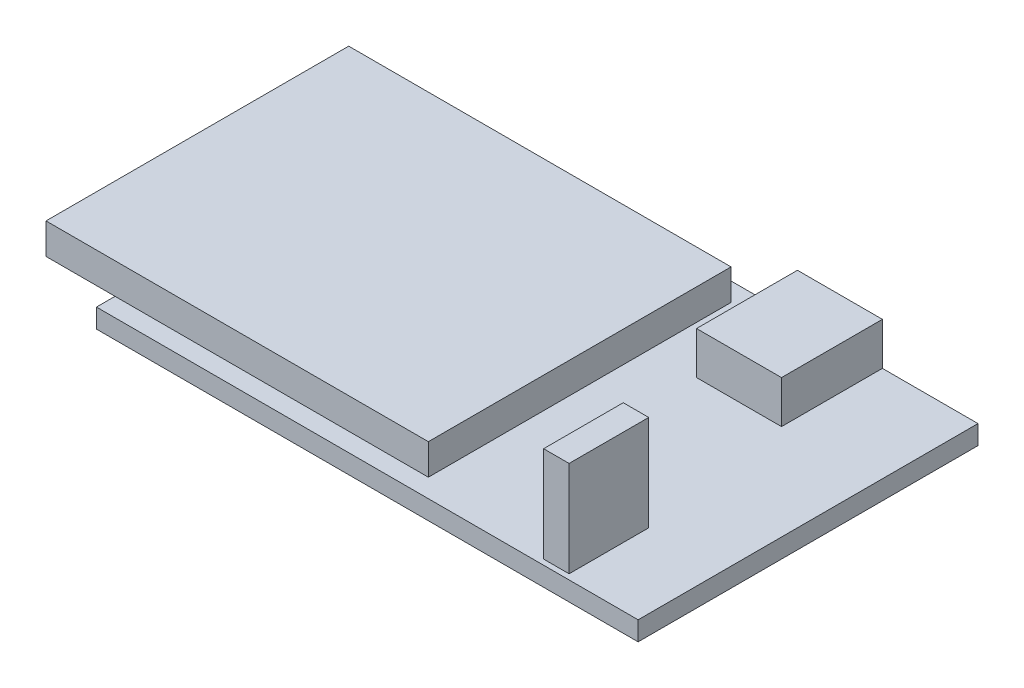
ISO-10303-21;
HEADER;
FILE_DESCRIPTION(('STEP AP214'),'2;1');
FILE_NAME('part.step','',(''),(''),'','','');
FILE_SCHEMA(('AUTOMOTIVE_DESIGN { 1 0 10303 214 1 1 1 1 }'));
ENDSEC;
DATA;
#1=APPLICATION_CONTEXT('core data for automotive mechanical design processes');
#2=APPLICATION_PROTOCOL_DEFINITION('international standard','automotive_design',2000,#1);
#3=PRODUCT_CONTEXT('',#1,'mechanical');
#4=PRODUCT('Part','Part','',(#3));
#5=PRODUCT_RELATED_PRODUCT_CATEGORY('part','',(#4));
#6=PRODUCT_DEFINITION_FORMATION('','',#4);
#7=PRODUCT_DEFINITION_CONTEXT('part definition',#1,'design');
#8=PRODUCT_DEFINITION('design','',#6,#7);
#9=PRODUCT_DEFINITION_SHAPE('','',#8);
#10=(LENGTH_UNIT() NAMED_UNIT(*) SI_UNIT(.MILLI.,.METRE.));
#11=(NAMED_UNIT(*) PLANE_ANGLE_UNIT() SI_UNIT($,.RADIAN.));
#12=(NAMED_UNIT(*) SI_UNIT($,.STERADIAN.) SOLID_ANGLE_UNIT());
#13=UNCERTAINTY_MEASURE_WITH_UNIT(LENGTH_MEASURE(1.E-05),#10,'distance_accuracy_value','');
#14=(GEOMETRIC_REPRESENTATION_CONTEXT(3) GLOBAL_UNCERTAINTY_ASSIGNED_CONTEXT((#13)) GLOBAL_UNIT_ASSIGNED_CONTEXT((#10,
#11,#12)) REPRESENTATION_CONTEXT('',''));
#15=CARTESIAN_POINT('',(0.,0.,0.));
#16=DIRECTION('',(0.,0.,1.));
#17=DIRECTION('',(1.,0.,0.));
#18=AXIS2_PLACEMENT_3D('',#15,#16,#17);
#19=CARTESIAN_POINT('',(0.,1.8,-32.));
#20=DIRECTION('',(0.,-1.,0.));
#21=DIRECTION('',(0.,0.,-1.));
#22=AXIS2_PLACEMENT_3D('',#19,#20,#21);
#23=PLANE('',#22);
#24=DIRECTION('',(0.,0.,1.));
#25=VECTOR('',#24,1.);
#26=CARTESIAN_POINT('',(41.6,1.8,-8.));
#27=LINE('',#26,#25);
#28=CARTESIAN_POINT('',(41.6,1.8,-8.));
#29=VERTEX_POINT('',#28);
#30=CARTESIAN_POINT('',(41.6,1.8,-0.5));
#31=VERTEX_POINT('',#30);
#32=EDGE_CURVE('E172',#29,#31,#27,.T.);
#33=ORIENTED_EDGE('',*,*,#32,.F.);
#34=DIRECTION('',(-1.,0.,0.));
#35=VECTOR('',#34,1.);
#36=CARTESIAN_POINT('',(41.6,1.8,-8.));
#37=LINE('',#36,#35);
#38=CARTESIAN_POINT('',(44.,1.8,-8.));
#39=VERTEX_POINT('',#38);
#40=EDGE_CURVE('E185',#39,#29,#37,.T.);
#41=ORIENTED_EDGE('',*,*,#40,.F.);
#42=DIRECTION('',(0.,0.,-1.));
#43=VECTOR('',#42,1.);
#44=CARTESIAN_POINT('',(44.,1.8,-8.));
#45=LINE('',#44,#43);
#46=CARTESIAN_POINT('',(44.,1.8,-0.5));
#47=VERTEX_POINT('',#46);
#48=EDGE_CURVE('E194',#47,#39,#45,.T.);
#49=ORIENTED_EDGE('',*,*,#48,.F.);
#50=DIRECTION('',(1.,0.,0.));
#51=VECTOR('',#50,1.);
#52=CARTESIAN_POINT('',(41.6,1.8,-0.5));
#53=LINE('',#52,#51);
#54=EDGE_CURVE('E175',#31,#47,#53,.T.);
#55=ORIENTED_EDGE('',*,*,#54,.F.);
#56=EDGE_LOOP('',(#33,#41,#49,#55));
#57=FACE_BOUND('',#56,.T.);
#58=DIRECTION('',(0.,0.,1.));
#59=VECTOR('',#58,1.);
#60=CARTESIAN_POINT('',(34.,1.8,-32.));
#61=LINE('',#60,#59);
#62=CARTESIAN_POINT('',(34.,1.8,-32.));
#63=VERTEX_POINT('',#62);
#64=CARTESIAN_POINT('',(34.,1.8,-22.5));
#65=VERTEX_POINT('',#64);
#66=EDGE_CURVE('E171',#63,#65,#61,.T.);
#67=ORIENTED_EDGE('',*,*,#66,.F.);
#68=DIRECTION('',(-1.,0.,0.));
#69=VECTOR('',#68,1.);
#70=CARTESIAN_POINT('',(0.,1.8,-32.));
#71=LINE('',#70,#69);
#72=CARTESIAN_POINT('',(0.,1.8,-32.));
#73=VERTEX_POINT('',#72);
#74=EDGE_CURVE('E250',#63,#73,#71,.T.);
#75=ORIENTED_EDGE('',*,*,#74,.T.);
#76=DIRECTION('',(0.,0.,1.));
#77=VECTOR('',#76,1.);
#78=CARTESIAN_POINT('',(0.,1.8,0.));
#79=LINE('',#78,#77);
#80=CARTESIAN_POINT('',(0.,1.8,-30.25));
#81=VERTEX_POINT('',#80);
#82=EDGE_CURVE('E242',#73,#81,#79,.T.);
#83=ORIENTED_EDGE('',*,*,#82,.T.);
#84=DIRECTION('',(-1.,0.,0.));
#85=VECTOR('',#84,1.);
#86=CARTESIAN_POINT('',(29.5,1.8,-30.25));
#87=LINE('',#86,#85);
#88=CARTESIAN_POINT('',(29.5,1.8,-30.25));
#89=VERTEX_POINT('',#88);
#90=EDGE_CURVE('E224',#89,#81,#87,.T.);
#91=ORIENTED_EDGE('',*,*,#90,.F.);
#92=DIRECTION('',(0.,0.,-1.));
#93=VECTOR('',#92,1.);
#94=CARTESIAN_POINT('',(29.5,1.8,-30.25));
#95=LINE('',#94,#93);
#96=CARTESIAN_POINT('',(29.5,1.8,-1.75000000000001));
#97=VERTEX_POINT('',#96);
#98=EDGE_CURVE('E210',#97,#89,#95,.T.);
#99=ORIENTED_EDGE('',*,*,#98,.F.);
#100=DIRECTION('',(1.,0.,0.));
#101=VECTOR('',#100,1.);
#102=CARTESIAN_POINT('',(29.5,1.8,-1.75000000000001));
#103=LINE('',#102,#101);
#104=CARTESIAN_POINT('',(0.,1.8,-1.75));
#105=VERTEX_POINT('',#104);
#106=EDGE_CURVE('E11',#105,#97,#103,.T.);
#107=ORIENTED_EDGE('',*,*,#106,.F.);
#108=CARTESIAN_POINT('',(0.,1.8,0.));
#109=VERTEX_POINT('',#108);
#110=EDGE_CURVE('E246',#105,#109,#79,.T.);
#111=ORIENTED_EDGE('',*,*,#110,.T.);
#112=DIRECTION('',(1.,0.,0.));
#113=VECTOR('',#112,1.);
#114=CARTESIAN_POINT('',(0.,1.8,0.));
#115=LINE('',#114,#113);
#116=CARTESIAN_POINT('',(51.,1.8,0.));
#117=VERTEX_POINT('',#116);
#118=EDGE_CURVE('E244',#109,#117,#115,.T.);
#119=ORIENTED_EDGE('',*,*,#118,.T.);
#120=DIRECTION('',(0.,0.,-1.));
#121=VECTOR('',#120,1.);
#122=CARTESIAN_POINT('',(51.,1.8,0.));
#123=LINE('',#122,#121);
#124=CARTESIAN_POINT('',(51.,1.8,-32.));
#125=VERTEX_POINT('',#124);
#126=EDGE_CURVE('E248',#117,#125,#123,.T.);
#127=ORIENTED_EDGE('',*,*,#126,.T.);
#128=CARTESIAN_POINT('',(42.,1.8,-32.));
#129=VERTEX_POINT('',#128);
#130=EDGE_CURVE('E251',#125,#129,#71,.T.);
#131=ORIENTED_EDGE('',*,*,#130,.T.);
#132=DIRECTION('',(0.,0.,-1.));
#133=VECTOR('',#132,1.);
#134=CARTESIAN_POINT('',(42.,1.8,-32.));
#135=LINE('',#134,#133);
#136=CARTESIAN_POINT('',(42.,1.8,-22.5));
#137=VERTEX_POINT('',#136);
#138=EDGE_CURVE('E52',#137,#129,#135,.T.);
#139=ORIENTED_EDGE('',*,*,#138,.F.);
#140=DIRECTION('',(1.,0.,0.));
#141=VECTOR('',#140,1.);
#142=CARTESIAN_POINT('',(34.,1.8,-22.5));
#143=LINE('',#142,#141);
#144=EDGE_CURVE('E47',#65,#137,#143,.T.);
#145=ORIENTED_EDGE('',*,*,#144,.F.);
#146=EDGE_LOOP('',(#67,#75,#83,#91,#99,#107,#111,#119,#127,#131,#139,#145));
#147=FACE_BOUND('',#146,.T.);
#148=ADVANCED_FACE('F30',(#57,#147),#23,.F.);
#149=CARTESIAN_POINT('',(0.,1.8,0.));
#150=DIRECTION('',(1.,0.,0.));
#151=DIRECTION('',(0.,0.,-1.));
#152=AXIS2_PLACEMENT_3D('',#149,#150,#151);
#153=PLANE('',#152);
#154=DIRECTION('',(0.,0.,1.));
#155=VECTOR('',#154,1.);
#156=CARTESIAN_POINT('',(0.,0.,0.));
#157=LINE('',#156,#155);
#158=CARTESIAN_POINT('',(0.,0.,-32.));
#159=VERTEX_POINT('',#158);
#160=CARTESIAN_POINT('',(0.,0.,0.));
#161=VERTEX_POINT('',#160);
#162=EDGE_CURVE('E241',#159,#161,#157,.T.);
#163=ORIENTED_EDGE('',*,*,#162,.T.);
#164=DIRECTION('',(0.,-1.,0.));
#165=VECTOR('',#164,1.);
#166=CARTESIAN_POINT('',(0.,1.8,0.));
#167=LINE('',#166,#165);
#168=EDGE_CURVE('E34',#109,#161,#167,.T.);
#169=ORIENTED_EDGE('',*,*,#168,.F.);
#170=ORIENTED_EDGE('',*,*,#110,.F.);
#171=EDGE_CURVE('E245',#81,#105,#79,.T.);
#172=ORIENTED_EDGE('',*,*,#171,.F.);
#173=ORIENTED_EDGE('',*,*,#82,.F.);
#174=DIRECTION('',(0.,-1.,0.));
#175=VECTOR('',#174,1.);
#176=CARTESIAN_POINT('',(0.,1.8,-32.));
#177=LINE('',#176,#175);
#178=EDGE_CURVE('E253',#73,#159,#177,.T.);
#179=ORIENTED_EDGE('',*,*,#178,.T.);
#180=EDGE_LOOP('',(#163,#169,#170,#172,#173,#179));
#181=FACE_BOUND('',#180,.T.);
#182=ADVANCED_FACE('F32',(#181),#153,.F.);
#183=CARTESIAN_POINT('',(0.,1.8,0.));
#184=DIRECTION('',(0.,0.,-1.));
#185=DIRECTION('',(-1.,0.,0.));
#186=AXIS2_PLACEMENT_3D('',#183,#184,#185);
#187=PLANE('',#186);
#188=DIRECTION('',(1.,0.,0.));
#189=VECTOR('',#188,1.);
#190=CARTESIAN_POINT('',(0.,0.,0.));
#191=LINE('',#190,#189);
#192=CARTESIAN_POINT('',(51.,0.,0.));
#193=VERTEX_POINT('',#192);
#194=EDGE_CURVE('E256',#161,#193,#191,.T.);
#195=ORIENTED_EDGE('',*,*,#194,.T.);
#196=DIRECTION('',(0.,-1.,0.));
#197=VECTOR('',#196,1.);
#198=CARTESIAN_POINT('',(51.,1.8,0.));
#199=LINE('',#198,#197);
#200=EDGE_CURVE('E266',#117,#193,#199,.T.);
#201=ORIENTED_EDGE('',*,*,#200,.F.);
#202=ORIENTED_EDGE('',*,*,#118,.F.);
#203=ORIENTED_EDGE('',*,*,#168,.T.);
#204=EDGE_LOOP('',(#195,#201,#202,#203));
#205=FACE_BOUND('',#204,.T.);
#206=ADVANCED_FACE('F276',(#205),#187,.F.);
#207=CARTESIAN_POINT('',(51.,1.8,0.));
#208=DIRECTION('',(-1.,0.,0.));
#209=DIRECTION('',(0.,0.,1.));
#210=AXIS2_PLACEMENT_3D('',#207,#208,#209);
#211=PLANE('',#210);
#212=DIRECTION('',(0.,0.,-1.));
#213=VECTOR('',#212,1.);
#214=CARTESIAN_POINT('',(51.,0.,0.));
#215=LINE('',#214,#213);
#216=CARTESIAN_POINT('',(51.,0.,-32.));
#217=VERTEX_POINT('',#216);
#218=EDGE_CURVE('E258',#193,#217,#215,.T.);
#219=ORIENTED_EDGE('',*,*,#218,.T.);
#220=DIRECTION('',(0.,-1.,0.));
#221=VECTOR('',#220,1.);
#222=CARTESIAN_POINT('',(51.,1.8,-32.));
#223=LINE('',#222,#221);
#224=EDGE_CURVE('E264',#125,#217,#223,.T.);
#225=ORIENTED_EDGE('',*,*,#224,.F.);
#226=ORIENTED_EDGE('',*,*,#126,.F.);
#227=ORIENTED_EDGE('',*,*,#200,.T.);
#228=EDGE_LOOP('',(#219,#225,#226,#227));
#229=FACE_BOUND('',#228,.T.);
#230=ADVANCED_FACE('F286',(#229),#211,.F.);
#231=CARTESIAN_POINT('',(0.,1.8,-32.));
#232=DIRECTION('',(0.,0.,1.));
#233=DIRECTION('',(1.,0.,0.));
#234=AXIS2_PLACEMENT_3D('',#231,#232,#233);
#235=PLANE('',#234);
#236=DIRECTION('',(-1.,0.,0.));
#237=VECTOR('',#236,1.);
#238=CARTESIAN_POINT('',(0.,0.,-32.));
#239=LINE('',#238,#237);
#240=EDGE_CURVE('E260',#217,#159,#239,.T.);
#241=ORIENTED_EDGE('',*,*,#240,.T.);
#242=ORIENTED_EDGE('',*,*,#178,.F.);
#243=ORIENTED_EDGE('',*,*,#74,.F.);
#244=DIRECTION('',(0.,-1.,0.));
#245=VECTOR('',#244,1.);
#246=CARTESIAN_POINT('',(34.,5.8,-32.));
#247=LINE('',#246,#245);
#248=CARTESIAN_POINT('',(34.,5.8,-32.));
#249=VERTEX_POINT('',#248);
#250=EDGE_CURVE('E298',#249,#63,#247,.T.);
#251=ORIENTED_EDGE('',*,*,#250,.F.);
#252=DIRECTION('',(-1.,0.,0.));
#253=VECTOR('',#252,1.);
#254=CARTESIAN_POINT('',(34.,5.8,-32.));
#255=LINE('',#254,#253);
#256=CARTESIAN_POINT('',(42.,5.8,-32.));
#257=VERTEX_POINT('',#256);
#258=EDGE_CURVE('E165',#257,#249,#255,.T.);
#259=ORIENTED_EDGE('',*,*,#258,.F.);
#260=DIRECTION('',(0.,-1.,0.));
#261=VECTOR('',#260,1.);
#262=CARTESIAN_POINT('',(42.,5.8,-32.));
#263=LINE('',#262,#261);
#264=EDGE_CURVE('E177',#257,#129,#263,.T.);
#265=ORIENTED_EDGE('',*,*,#264,.T.);
#266=ORIENTED_EDGE('',*,*,#130,.F.);
#267=ORIENTED_EDGE('',*,*,#224,.T.);
#268=EDGE_LOOP('',(#241,#242,#243,#251,#259,#265,#266,#267));
#269=FACE_BOUND('',#268,.T.);
#270=ADVANCED_FACE('F289',(#269),#235,.F.);
#271=CARTESIAN_POINT('',(0.,0.,-32.));
#272=DIRECTION('',(0.,-1.,0.));
#273=DIRECTION('',(0.,0.,-1.));
#274=AXIS2_PLACEMENT_3D('',#271,#272,#273);
#275=PLANE('',#274);
#276=ORIENTED_EDGE('',*,*,#162,.F.);
#277=ORIENTED_EDGE('',*,*,#240,.F.);
#278=ORIENTED_EDGE('',*,*,#218,.F.);
#279=ORIENTED_EDGE('',*,*,#194,.F.);
#280=EDGE_LOOP('',(#276,#277,#278,#279));
#281=FACE_BOUND('',#280,.T.);
#282=ADVANCED_FACE('F284',(#281),#275,.T.);
#283=CARTESIAN_POINT('',(29.5,4.7,-30.25));
#284=DIRECTION('',(-1.,0.,0.));
#285=DIRECTION('',(0.,0.,1.));
#286=AXIS2_PLACEMENT_3D('',#283,#284,#285);
#287=PLANE('',#286);
#288=ORIENTED_EDGE('',*,*,#98,.T.);
#289=DIRECTION('',(0.,-1.,0.));
#290=VECTOR('',#289,1.);
#291=CARTESIAN_POINT('',(29.5,4.7,-30.25));
#292=LINE('',#291,#290);
#293=CARTESIAN_POINT('',(29.5,4.7,-30.25));
#294=VERTEX_POINT('',#293);
#295=EDGE_CURVE('E238',#294,#89,#292,.T.);
#296=ORIENTED_EDGE('',*,*,#295,.F.);
#297=DIRECTION('',(0.,0.,-1.));
#298=VECTOR('',#297,1.);
#299=CARTESIAN_POINT('',(29.5,4.7,-30.25));
#300=LINE('',#299,#298);
#301=CARTESIAN_POINT('',(29.5,4.7,-1.75000000000001));
#302=VERTEX_POINT('',#301);
#303=EDGE_CURVE('E211',#302,#294,#300,.T.);
#304=ORIENTED_EDGE('',*,*,#303,.F.);
#305=DIRECTION('',(0.,-1.,0.));
#306=VECTOR('',#305,1.);
#307=CARTESIAN_POINT('',(29.5,4.7,-1.75000000000001));
#308=LINE('',#307,#306);
#309=EDGE_CURVE('E220',#302,#97,#308,.T.);
#310=ORIENTED_EDGE('',*,*,#309,.T.);
#311=EDGE_LOOP('',(#288,#296,#304,#310));
#312=FACE_BOUND('',#311,.T.);
#313=ADVANCED_FACE('F314',(#312),#287,.F.);
#314=CARTESIAN_POINT('',(29.5,4.7,-30.25));
#315=DIRECTION('',(0.,0.,1.));
#316=DIRECTION('',(1.,0.,0.));
#317=AXIS2_PLACEMENT_3D('',#314,#315,#316);
#318=PLANE('',#317);
#319=ORIENTED_EDGE('',*,*,#90,.T.);
#320=CARTESIAN_POINT('',(-6.5,1.8,-30.25));
#321=VERTEX_POINT('',#320);
#322=EDGE_CURVE('E223',#81,#321,#87,.T.);
#323=ORIENTED_EDGE('',*,*,#322,.T.);
#324=DIRECTION('',(0.,-1.,0.));
#325=VECTOR('',#324,1.);
#326=CARTESIAN_POINT('',(-6.5,4.7,-30.25));
#327=LINE('',#326,#325);
#328=CARTESIAN_POINT('',(-6.5,4.7,-30.25));
#329=VERTEX_POINT('',#328);
#330=EDGE_CURVE('E235',#329,#321,#327,.T.);
#331=ORIENTED_EDGE('',*,*,#330,.F.);
#332=DIRECTION('',(-1.,0.,0.));
#333=VECTOR('',#332,1.);
#334=CARTESIAN_POINT('',(29.5,4.7,-30.25));
#335=LINE('',#334,#333);
#336=EDGE_CURVE('E214',#294,#329,#335,.T.);
#337=ORIENTED_EDGE('',*,*,#336,.F.);
#338=ORIENTED_EDGE('',*,*,#295,.T.);
#339=EDGE_LOOP('',(#319,#323,#331,#337,#338));
#340=FACE_BOUND('',#339,.T.);
#341=ADVANCED_FACE('F310',(#340),#318,.F.);
#342=CARTESIAN_POINT('',(-6.5,4.7,-30.25));
#343=DIRECTION('',(1.,0.,0.));
#344=DIRECTION('',(0.,0.,-1.));
#345=AXIS2_PLACEMENT_3D('',#342,#343,#344);
#346=PLANE('',#345);
#347=DIRECTION('',(0.,0.,1.));
#348=VECTOR('',#347,1.);
#349=CARTESIAN_POINT('',(-6.5,1.8,-30.25));
#350=LINE('',#349,#348);
#351=CARTESIAN_POINT('',(-6.5,1.8,-1.75));
#352=VERTEX_POINT('',#351);
#353=EDGE_CURVE('E227',#321,#352,#350,.T.);
#354=ORIENTED_EDGE('',*,*,#353,.T.);
#355=DIRECTION('',(0.,-1.,0.));
#356=VECTOR('',#355,1.);
#357=CARTESIAN_POINT('',(-6.5,4.7,-1.75));
#358=LINE('',#357,#356);
#359=CARTESIAN_POINT('',(-6.5,4.7,-1.75));
#360=VERTEX_POINT('',#359);
#361=EDGE_CURVE('E232',#360,#352,#358,.T.);
#362=ORIENTED_EDGE('',*,*,#361,.F.);
#363=DIRECTION('',(0.,0.,1.));
#364=VECTOR('',#363,1.);
#365=CARTESIAN_POINT('',(-6.5,4.7,-30.25));
#366=LINE('',#365,#364);
#367=EDGE_CURVE('E216',#329,#360,#366,.T.);
#368=ORIENTED_EDGE('',*,*,#367,.F.);
#369=ORIENTED_EDGE('',*,*,#330,.T.);
#370=EDGE_LOOP('',(#354,#362,#368,#369));
#371=FACE_BOUND('',#370,.T.);
#372=ADVANCED_FACE('F322',(#371),#346,.F.);
#373=CARTESIAN_POINT('',(29.5,4.7,-1.75000000000001));
#374=DIRECTION('',(0.,0.,-1.));
#375=DIRECTION('',(-1.,0.,0.));
#376=AXIS2_PLACEMENT_3D('',#373,#374,#375);
#377=PLANE('',#376);
#378=EDGE_CURVE('E40',#352,#105,#103,.T.);
#379=ORIENTED_EDGE('',*,*,#378,.T.);
#380=ORIENTED_EDGE('',*,*,#106,.T.);
#381=ORIENTED_EDGE('',*,*,#309,.F.);
#382=DIRECTION('',(1.,0.,0.));
#383=VECTOR('',#382,1.);
#384=CARTESIAN_POINT('',(29.5,4.7,-1.75000000000001));
#385=LINE('',#384,#383);
#386=EDGE_CURVE('E218',#360,#302,#385,.T.);
#387=ORIENTED_EDGE('',*,*,#386,.F.);
#388=ORIENTED_EDGE('',*,*,#361,.T.);
#389=EDGE_LOOP('',(#379,#380,#381,#387,#388));
#390=FACE_BOUND('',#389,.T.);
#391=ADVANCED_FACE('F317',(#390),#377,.F.);
#392=CARTESIAN_POINT('',(29.5,4.7,-1.75000000000001));
#393=DIRECTION('',(0.,-1.,0.));
#394=DIRECTION('',(0.,0.,-1.));
#395=AXIS2_PLACEMENT_3D('',#392,#393,#394);
#396=PLANE('',#395);
#397=ORIENTED_EDGE('',*,*,#303,.T.);
#398=ORIENTED_EDGE('',*,*,#336,.T.);
#399=ORIENTED_EDGE('',*,*,#367,.T.);
#400=ORIENTED_EDGE('',*,*,#386,.T.);
#401=EDGE_LOOP('',(#397,#398,#399,#400));
#402=FACE_BOUND('',#401,.T.);
#403=ADVANCED_FACE('F324',(#402),#396,.F.);
#404=CARTESIAN_POINT('',(29.5,1.8,-1.75000000000001));
#405=DIRECTION('',(0.,-1.,0.));
#406=DIRECTION('',(0.,0.,-1.));
#407=AXIS2_PLACEMENT_3D('',#404,#405,#406);
#408=PLANE('',#407);
#409=ORIENTED_EDGE('',*,*,#322,.F.);
#410=ORIENTED_EDGE('',*,*,#171,.T.);
#411=ORIENTED_EDGE('',*,*,#378,.F.);
#412=ORIENTED_EDGE('',*,*,#353,.F.);
#413=EDGE_LOOP('',(#409,#410,#411,#412));
#414=FACE_BOUND('',#413,.T.);
#415=ADVANCED_FACE('F307',(#414),#408,.T.);
#416=CARTESIAN_POINT('',(41.6,10.8,-8.));
#417=DIRECTION('',(1.,0.,0.));
#418=DIRECTION('',(0.,0.,-1.));
#419=AXIS2_PLACEMENT_3D('',#416,#417,#418);
#420=PLANE('',#419);
#421=ORIENTED_EDGE('',*,*,#32,.T.);
#422=DIRECTION('',(0.,-1.,0.));
#423=VECTOR('',#422,1.);
#424=CARTESIAN_POINT('',(41.6,10.8,-0.5));
#425=LINE('',#424,#423);
#426=CARTESIAN_POINT('',(41.6,10.8,-0.5));
#427=VERTEX_POINT('',#426);
#428=EDGE_CURVE('E207',#427,#31,#425,.T.);
#429=ORIENTED_EDGE('',*,*,#428,.F.);
#430=DIRECTION('',(0.,0.,1.));
#431=VECTOR('',#430,1.);
#432=CARTESIAN_POINT('',(41.6,10.8,-8.));
#433=LINE('',#432,#431);
#434=CARTESIAN_POINT('',(41.6,10.8,-8.));
#435=VERTEX_POINT('',#434);
#436=EDGE_CURVE('E181',#435,#427,#433,.T.);
#437=ORIENTED_EDGE('',*,*,#436,.F.);
#438=DIRECTION('',(0.,-1.,0.));
#439=VECTOR('',#438,1.);
#440=CARTESIAN_POINT('',(41.6,10.8,-8.));
#441=LINE('',#440,#439);
#442=EDGE_CURVE('E190',#435,#29,#441,.T.);
#443=ORIENTED_EDGE('',*,*,#442,.T.);
#444=EDGE_LOOP('',(#421,#429,#437,#443));
#445=FACE_BOUND('',#444,.T.);
#446=ADVANCED_FACE('F331',(#445),#420,.F.);
#447=CARTESIAN_POINT('',(41.6,10.8,-0.5));
#448=DIRECTION('',(0.,0.,-1.));
#449=DIRECTION('',(-1.,0.,0.));
#450=AXIS2_PLACEMENT_3D('',#447,#448,#449);
#451=PLANE('',#450);
#452=ORIENTED_EDGE('',*,*,#54,.T.);
#453=DIRECTION('',(0.,-1.,0.));
#454=VECTOR('',#453,1.);
#455=CARTESIAN_POINT('',(44.,10.8,-0.5));
#456=LINE('',#455,#454);
#457=CARTESIAN_POINT('',(44.,10.8,-0.5));
#458=VERTEX_POINT('',#457);
#459=EDGE_CURVE('E204',#458,#47,#456,.T.);
#460=ORIENTED_EDGE('',*,*,#459,.F.);
#461=DIRECTION('',(1.,0.,0.));
#462=VECTOR('',#461,1.);
#463=CARTESIAN_POINT('',(41.6,10.8,-0.5));
#464=LINE('',#463,#462);
#465=EDGE_CURVE('E184',#427,#458,#464,.T.);
#466=ORIENTED_EDGE('',*,*,#465,.F.);
#467=ORIENTED_EDGE('',*,*,#428,.T.);
#468=EDGE_LOOP('',(#452,#460,#466,#467));
#469=FACE_BOUND('',#468,.T.);
#470=ADVANCED_FACE('F406',(#469),#451,.F.);
#471=CARTESIAN_POINT('',(44.,10.8,-8.));
#472=DIRECTION('',(-1.,0.,0.));
#473=DIRECTION('',(0.,0.,1.));
#474=AXIS2_PLACEMENT_3D('',#471,#472,#473);
#475=PLANE('',#474);
#476=ORIENTED_EDGE('',*,*,#48,.T.);
#477=DIRECTION('',(0.,-1.,0.));
#478=VECTOR('',#477,1.);
#479=CARTESIAN_POINT('',(44.,10.8,-8.));
#480=LINE('',#479,#478);
#481=CARTESIAN_POINT('',(44.,10.8,-8.));
#482=VERTEX_POINT('',#481);
#483=EDGE_CURVE('E201',#482,#39,#480,.T.);
#484=ORIENTED_EDGE('',*,*,#483,.F.);
#485=DIRECTION('',(0.,0.,-1.));
#486=VECTOR('',#485,1.);
#487=CARTESIAN_POINT('',(44.,10.8,-8.));
#488=LINE('',#487,#486);
#489=EDGE_CURVE('E187',#458,#482,#488,.T.);
#490=ORIENTED_EDGE('',*,*,#489,.F.);
#491=ORIENTED_EDGE('',*,*,#459,.T.);
#492=EDGE_LOOP('',(#476,#484,#490,#491));
#493=FACE_BOUND('',#492,.T.);
#494=ADVANCED_FACE('F415',(#493),#475,.F.);
#495=CARTESIAN_POINT('',(41.6,10.8,-8.));
#496=DIRECTION('',(0.,0.,1.));
#497=DIRECTION('',(1.,0.,0.));
#498=AXIS2_PLACEMENT_3D('',#495,#496,#497);
#499=PLANE('',#498);
#500=ORIENTED_EDGE('',*,*,#40,.T.);
#501=ORIENTED_EDGE('',*,*,#442,.F.);
#502=DIRECTION('',(-1.,0.,0.));
#503=VECTOR('',#502,1.);
#504=CARTESIAN_POINT('',(41.6,10.8,-8.));
#505=LINE('',#504,#503);
#506=EDGE_CURVE('E189',#482,#435,#505,.T.);
#507=ORIENTED_EDGE('',*,*,#506,.F.);
#508=ORIENTED_EDGE('',*,*,#483,.T.);
#509=EDGE_LOOP('',(#500,#501,#507,#508));
#510=FACE_BOUND('',#509,.T.);
#511=ADVANCED_FACE('F425',(#510),#499,.F.);
#512=CARTESIAN_POINT('',(41.6,10.8,-0.5));
#513=DIRECTION('',(0.,1.,0.));
#514=DIRECTION('',(0.,0.,1.));
#515=AXIS2_PLACEMENT_3D('',#512,#513,#514);
#516=PLANE('',#515);
#517=ORIENTED_EDGE('',*,*,#436,.T.);
#518=ORIENTED_EDGE('',*,*,#465,.T.);
#519=ORIENTED_EDGE('',*,*,#489,.T.);
#520=ORIENTED_EDGE('',*,*,#506,.T.);
#521=EDGE_LOOP('',(#517,#518,#519,#520));
#522=FACE_BOUND('',#521,.T.);
#523=ADVANCED_FACE('F435',(#522),#516,.T.);
#524=CARTESIAN_POINT('',(34.,5.8,-32.));
#525=DIRECTION('',(1.,0.,0.));
#526=DIRECTION('',(0.,0.,-1.));
#527=AXIS2_PLACEMENT_3D('',#524,#525,#526);
#528=PLANE('',#527);
#529=ORIENTED_EDGE('',*,*,#66,.T.);
#530=DIRECTION('',(0.,-1.,0.));
#531=VECTOR('',#530,1.);
#532=CARTESIAN_POINT('',(34.,5.8,-22.5));
#533=LINE('',#532,#531);
#534=CARTESIAN_POINT('',(34.,5.8,-22.5));
#535=VERTEX_POINT('',#534);
#536=EDGE_CURVE('E153',#535,#65,#533,.T.);
#537=ORIENTED_EDGE('',*,*,#536,.F.);
#538=DIRECTION('',(0.,0.,1.));
#539=VECTOR('',#538,1.);
#540=CARTESIAN_POINT('',(34.,5.8,-32.));
#541=LINE('',#540,#539);
#542=EDGE_CURVE('E160',#249,#535,#541,.T.);
#543=ORIENTED_EDGE('',*,*,#542,.F.);
#544=ORIENTED_EDGE('',*,*,#250,.T.);
#545=EDGE_LOOP('',(#529,#537,#543,#544));
#546=FACE_BOUND('',#545,.T.);
#547=ADVANCED_FACE('F170',(#546),#528,.F.);
#548=CARTESIAN_POINT('',(34.,5.8,-22.5));
#549=DIRECTION('',(0.,0.,-1.));
#550=DIRECTION('',(-1.,0.,0.));
#551=AXIS2_PLACEMENT_3D('',#548,#549,#550);
#552=PLANE('',#551);
#553=ORIENTED_EDGE('',*,*,#144,.T.);
#554=DIRECTION('',(0.,-1.,0.));
#555=VECTOR('',#554,1.);
#556=CARTESIAN_POINT('',(42.,5.8,-22.5));
#557=LINE('',#556,#555);
#558=CARTESIAN_POINT('',(42.,5.8,-22.5));
#559=VERTEX_POINT('',#558);
#560=EDGE_CURVE('E156',#559,#137,#557,.T.);
#561=ORIENTED_EDGE('',*,*,#560,.F.);
#562=DIRECTION('',(1.,0.,0.));
#563=VECTOR('',#562,1.);
#564=CARTESIAN_POINT('',(34.,5.8,-22.5));
#565=LINE('',#564,#563);
#566=EDGE_CURVE('E149',#535,#559,#565,.T.);
#567=ORIENTED_EDGE('',*,*,#566,.F.);
#568=ORIENTED_EDGE('',*,*,#536,.T.);
#569=EDGE_LOOP('',(#553,#561,#567,#568));
#570=FACE_BOUND('',#569,.T.);
#571=ADVANCED_FACE('F151',(#570),#552,.F.);
#572=CARTESIAN_POINT('',(42.,5.8,-32.));
#573=DIRECTION('',(-1.,0.,0.));
#574=DIRECTION('',(0.,0.,1.));
#575=AXIS2_PLACEMENT_3D('',#572,#573,#574);
#576=PLANE('',#575);
#577=ORIENTED_EDGE('',*,*,#138,.T.);
#578=ORIENTED_EDGE('',*,*,#264,.F.);
#579=DIRECTION('',(0.,0.,-1.));
#580=VECTOR('',#579,1.);
#581=CARTESIAN_POINT('',(42.,5.8,-32.));
#582=LINE('',#581,#580);
#583=EDGE_CURVE('E159',#559,#257,#582,.T.);
#584=ORIENTED_EDGE('',*,*,#583,.F.);
#585=ORIENTED_EDGE('',*,*,#560,.T.);
#586=EDGE_LOOP('',(#577,#578,#584,#585));
#587=FACE_BOUND('',#586,.T.);
#588=ADVANCED_FACE('F293',(#587),#576,.F.);
#589=CARTESIAN_POINT('',(34.,5.8,-22.5));
#590=DIRECTION('',(0.,1.,0.));
#591=DIRECTION('',(0.,0.,1.));
#592=AXIS2_PLACEMENT_3D('',#589,#590,#591);
#593=PLANE('',#592);
#594=ORIENTED_EDGE('',*,*,#542,.T.);
#595=ORIENTED_EDGE('',*,*,#566,.T.);
#596=ORIENTED_EDGE('',*,*,#583,.T.);
#597=ORIENTED_EDGE('',*,*,#258,.T.);
#598=EDGE_LOOP('',(#594,#595,#596,#597));
#599=FACE_BOUND('',#598,.T.);
#600=ADVANCED_FACE('F163',(#599),#593,.T.);
#601=CLOSED_SHELL('',(#148,#182,#206,#230,#270,#282,#313,#341,#372,#391,#403,#415,#446,#470,
#494,#511,#523,#547,#571,#588,#600));
#602=MANIFOLD_SOLID_BREP('B2',#601);
#603=ADVANCED_BREP_SHAPE_REPRESENTATION('',(#18,#602),#14);
#604=SHAPE_DEFINITION_REPRESENTATION(#9,#603);
ENDSEC;
END-ISO-10303-21;
